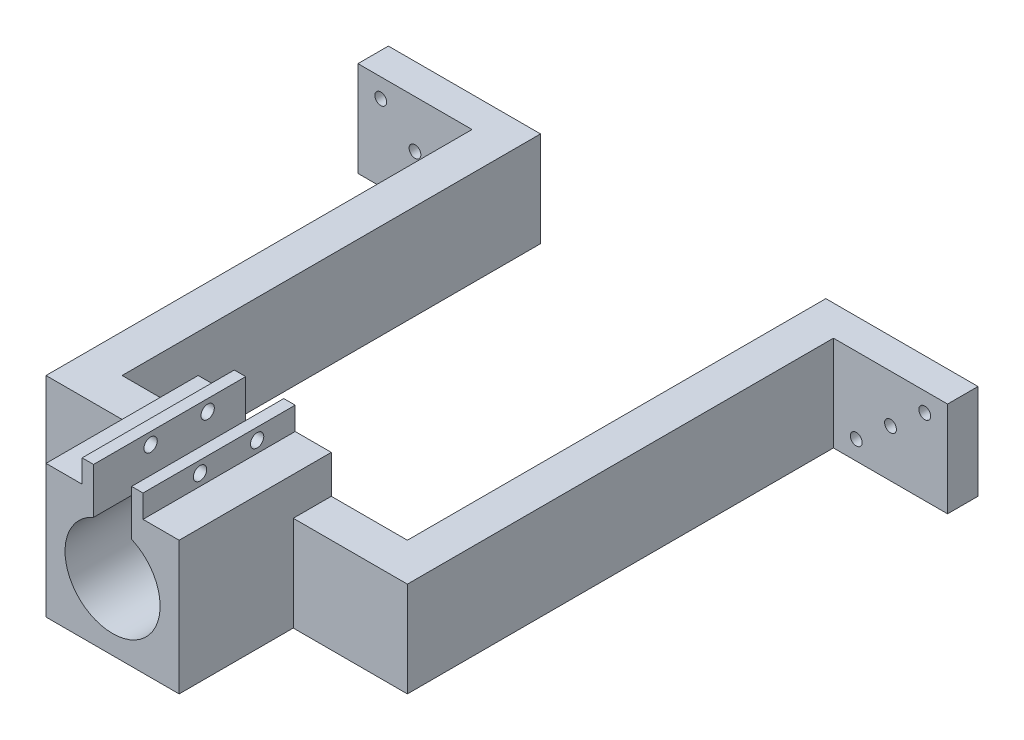
ISO-10303-21;
HEADER;
FILE_DESCRIPTION(('STEP AP214'),'2;1');
FILE_NAME('part.step','',(''),(''),'','','');
FILE_SCHEMA(('AUTOMOTIVE_DESIGN { 1 0 10303 214 1 1 1 1 }'));
ENDSEC;
DATA;
#1=APPLICATION_CONTEXT('core data for automotive mechanical design processes');
#2=APPLICATION_PROTOCOL_DEFINITION('international standard','automotive_design',2000,#1);
#3=PRODUCT_CONTEXT('',#1,'mechanical');
#4=PRODUCT('Part','Part','',(#3));
#5=PRODUCT_RELATED_PRODUCT_CATEGORY('part','',(#4));
#6=PRODUCT_DEFINITION_FORMATION('','',#4);
#7=PRODUCT_DEFINITION_CONTEXT('part definition',#1,'design');
#8=PRODUCT_DEFINITION('design','',#6,#7);
#9=PRODUCT_DEFINITION_SHAPE('','',#8);
#10=(LENGTH_UNIT() NAMED_UNIT(*) SI_UNIT(.MILLI.,.METRE.));
#11=(NAMED_UNIT(*) PLANE_ANGLE_UNIT() SI_UNIT($,.RADIAN.));
#12=(NAMED_UNIT(*) SI_UNIT($,.STERADIAN.) SOLID_ANGLE_UNIT());
#13=UNCERTAINTY_MEASURE_WITH_UNIT(LENGTH_MEASURE(1.E-05),#10,'distance_accuracy_value','');
#14=(GEOMETRIC_REPRESENTATION_CONTEXT(3) GLOBAL_UNCERTAINTY_ASSIGNED_CONTEXT((#13)) GLOBAL_UNIT_ASSIGNED_CONTEXT((#10,
#11,#12)) REPRESENTATION_CONTEXT('',''));
#15=CARTESIAN_POINT('',(0.,0.,0.));
#16=DIRECTION('',(0.,0.,1.));
#17=DIRECTION('',(1.,0.,0.));
#18=AXIS2_PLACEMENT_3D('',#15,#16,#17);
#19=CARTESIAN_POINT('',(0.,0.,0.));
#20=DIRECTION('',(0.,0.,1.));
#21=DIRECTION('',(1.,0.,0.));
#22=AXIS2_PLACEMENT_3D('',#19,#20,#21);
#23=PLANE('',#22);
#24=DIRECTION('',(1.,0.,0.));
#25=VECTOR('',#24,1.);
#26=CARTESIAN_POINT('',(0.,7.49999999999999,0.));
#27=LINE('',#26,#25);
#28=CARTESIAN_POINT('',(17.5,7.5,0.));
#29=VERTEX_POINT('',#28);
#30=CARTESIAN_POINT('',(37.5,7.5,0.));
#31=VERTEX_POINT('',#30);
#32=EDGE_CURVE('E437',#29,#31,#27,.T.);
#33=ORIENTED_EDGE('',*,*,#32,.T.);
#34=DIRECTION('',(0.,-1.,0.));
#35=VECTOR('',#34,1.);
#36=CARTESIAN_POINT('',(37.5,0.,0.));
#37=LINE('',#36,#35);
#38=CARTESIAN_POINT('',(37.5,-17.5,0.));
#39=VERTEX_POINT('',#38);
#40=EDGE_CURVE('E616',#31,#39,#37,.T.);
#41=ORIENTED_EDGE('',*,*,#40,.T.);
#42=DIRECTION('',(1.,0.,0.));
#43=VECTOR('',#42,1.);
#44=CARTESIAN_POINT('',(0.,-17.5,0.));
#45=LINE('',#44,#43);
#46=CARTESIAN_POINT('',(-37.5,-17.5,0.));
#47=VERTEX_POINT('',#46);
#48=EDGE_CURVE('E368',#47,#39,#45,.T.);
#49=ORIENTED_EDGE('',*,*,#48,.F.);
#50=DIRECTION('',(0.,-1.,0.));
#51=VECTOR('',#50,1.);
#52=CARTESIAN_POINT('',(-37.5,0.,0.));
#53=LINE('',#52,#51);
#54=CARTESIAN_POINT('',(-37.5,7.5,0.));
#55=VERTEX_POINT('',#54);
#56=EDGE_CURVE('E469',#55,#47,#53,.T.);
#57=ORIENTED_EDGE('',*,*,#56,.F.);
#58=DIRECTION('',(-1.,0.,0.));
#59=VECTOR('',#58,1.);
#60=CARTESIAN_POINT('',(0.,7.5,0.));
#61=LINE('',#60,#59);
#62=CARTESIAN_POINT('',(-17.5,7.5,0.));
#63=VERTEX_POINT('',#62);
#64=EDGE_CURVE('E462',#63,#55,#61,.T.);
#65=ORIENTED_EDGE('',*,*,#64,.F.);
#66=DIRECTION('',(0.,1.,0.));
#67=VECTOR('',#66,1.);
#68=CARTESIAN_POINT('',(-17.5,0.,0.));
#69=LINE('',#68,#67);
#70=CARTESIAN_POINT('',(-17.5,17.5,0.));
#71=VERTEX_POINT('',#70);
#72=EDGE_CURVE('E359',#63,#71,#69,.T.);
#73=ORIENTED_EDGE('',*,*,#72,.T.);
#74=DIRECTION('',(1.,0.,0.));
#75=VECTOR('',#74,1.);
#76=CARTESIAN_POINT('',(0.,17.5,0.));
#77=LINE('',#76,#75);
#78=CARTESIAN_POINT('',(-8.00000000000002,17.5,0.));
#79=VERTEX_POINT('',#78);
#80=EDGE_CURVE('E356',#71,#79,#77,.T.);
#81=ORIENTED_EDGE('',*,*,#80,.T.);
#82=DIRECTION('',(0.,1.,0.));
#83=VECTOR('',#82,1.);
#84=CARTESIAN_POINT('',(-8.00000000000002,0.,0.));
#85=LINE('',#84,#83);
#86=CARTESIAN_POINT('',(-8.00000000000002,23.5,0.));
#87=VERTEX_POINT('',#86);
#88=EDGE_CURVE('E353',#79,#87,#85,.T.);
#89=ORIENTED_EDGE('',*,*,#88,.T.);
#90=DIRECTION('',(-1.,0.,0.));
#91=VECTOR('',#90,1.);
#92=CARTESIAN_POINT('',(0.,23.5,0.));
#93=LINE('',#92,#91);
#94=CARTESIAN_POINT('',(-5.,23.5,0.));
#95=VERTEX_POINT('',#94);
#96=EDGE_CURVE('E350',#95,#87,#93,.T.);
#97=ORIENTED_EDGE('',*,*,#96,.F.);
#98=DIRECTION('',(0.,1.,0.));
#99=VECTOR('',#98,1.);
#100=CARTESIAN_POINT('',(-5.,0.,0.));
#101=LINE('',#100,#99);
#102=CARTESIAN_POINT('',(-5.,11.4564392373896,0.));
#103=VERTEX_POINT('',#102);
#104=EDGE_CURVE('E348',#103,#95,#101,.T.);
#105=ORIENTED_EDGE('',*,*,#104,.F.);
#106=CARTESIAN_POINT('',(0.,0.,0.));
#107=DIRECTION('',(0.,0.,1.));
#108=DIRECTION('',(1.,0.,0.));
#109=AXIS2_PLACEMENT_3D('',#106,#107,#108);
#110=CIRCLE('',#109,12.5);
#111=CARTESIAN_POINT('',(5.,11.4564392373896,0.));
#112=VERTEX_POINT('',#111);
#113=EDGE_CURVE('E314',#103,#112,#110,.T.);
#114=ORIENTED_EDGE('',*,*,#113,.T.);
#115=DIRECTION('',(0.,1.,0.));
#116=VECTOR('',#115,1.);
#117=CARTESIAN_POINT('',(5.,0.,0.));
#118=LINE('',#117,#116);
#119=CARTESIAN_POINT('',(5.,23.5,0.));
#120=VERTEX_POINT('',#119);
#121=EDGE_CURVE('E319',#112,#120,#118,.T.);
#122=ORIENTED_EDGE('',*,*,#121,.T.);
#123=DIRECTION('',(1.,0.,0.));
#124=VECTOR('',#123,1.);
#125=CARTESIAN_POINT('',(0.,23.5,0.));
#126=LINE('',#125,#124);
#127=CARTESIAN_POINT('',(7.99999999999999,23.5,0.));
#128=VERTEX_POINT('',#127);
#129=EDGE_CURVE('E409',#120,#128,#126,.T.);
#130=ORIENTED_EDGE('',*,*,#129,.T.);
#131=DIRECTION('',(0.,1.,0.));
#132=VECTOR('',#131,1.);
#133=CARTESIAN_POINT('',(7.99999999999999,0.,0.));
#134=LINE('',#133,#132);
#135=CARTESIAN_POINT('',(7.99999999999999,17.5,0.));
#136=VERTEX_POINT('',#135);
#137=EDGE_CURVE('E411',#136,#128,#134,.T.);
#138=ORIENTED_EDGE('',*,*,#137,.F.);
#139=CARTESIAN_POINT('',(17.5,17.5,0.));
#140=VERTEX_POINT('',#139);
#141=EDGE_CURVE('E360',#136,#140,#77,.T.);
#142=ORIENTED_EDGE('',*,*,#141,.T.);
#143=DIRECTION('',(0.,1.,0.));
#144=VECTOR('',#143,1.);
#145=CARTESIAN_POINT('',(17.5,0.,0.));
#146=LINE('',#145,#144);
#147=EDGE_CURVE('E435',#29,#140,#146,.T.);
#148=ORIENTED_EDGE('',*,*,#147,.F.);
#149=EDGE_LOOP('',(#33,#41,#49,#57,#65,#73,#81,#89,#97,#105,#114,#122,#130,#138,#142,#148));
#150=FACE_BOUND('',#149,.T.);
#151=ADVANCED_FACE('F35',(#150),#23,.F.);
#152=CARTESIAN_POINT('',(0.,0.,40.));
#153=DIRECTION('',(0.,0.,-1.));
#154=DIRECTION('',(-1.,0.,0.));
#155=AXIS2_PLACEMENT_3D('',#152,#153,#154);
#156=CYLINDRICAL_SURFACE('',#155,12.5);
#157=ORIENTED_EDGE('',*,*,#113,.F.);
#158=DIRECTION('',(0.,0.,-1.));
#159=VECTOR('',#158,1.);
#160=CARTESIAN_POINT('',(-5.,11.4564392373896,40.));
#161=LINE('',#160,#159);
#162=CARTESIAN_POINT('',(-5.,11.4564392373896,40.));
#163=VERTEX_POINT('',#162);
#164=EDGE_CURVE('E11',#163,#103,#161,.T.);
#165=ORIENTED_EDGE('',*,*,#164,.F.);
#166=CARTESIAN_POINT('',(0.,0.,40.));
#167=DIRECTION('',(0.,0.,1.));
#168=DIRECTION('',(1.,0.,0.));
#169=AXIS2_PLACEMENT_3D('',#166,#167,#168);
#170=CIRCLE('',#169,12.5);
#171=CARTESIAN_POINT('',(5.,11.4564392373896,40.));
#172=VERTEX_POINT('',#171);
#173=EDGE_CURVE('E315',#163,#172,#170,.T.);
#174=ORIENTED_EDGE('',*,*,#173,.T.);
#175=DIRECTION('',(0.,0.,-1.));
#176=VECTOR('',#175,1.);
#177=CARTESIAN_POINT('',(5.,11.4564392373896,40.));
#178=LINE('',#177,#176);
#179=EDGE_CURVE('E345',#172,#112,#178,.T.);
#180=ORIENTED_EDGE('',*,*,#179,.T.);
#181=EDGE_LOOP('',(#157,#165,#174,#180));
#182=FACE_BOUND('',#181,.T.);
#183=ADVANCED_FACE('F37',(#182),#156,.F.);
#184=CARTESIAN_POINT('',(-5.,0.,40.));
#185=DIRECTION('',(-1.,0.,0.));
#186=DIRECTION('',(0.,0.,1.));
#187=AXIS2_PLACEMENT_3D('',#184,#185,#186);
#188=PLANE('',#187);
#189=CARTESIAN_POINT('',(-5.,20.5,10.));
#190=DIRECTION('',(-1.,0.,0.));
#191=DIRECTION('',(0.,0.,1.));
#192=AXIS2_PLACEMENT_3D('',#189,#190,#191);
#193=CIRCLE('',#192,1.75);
#194=CARTESIAN_POINT('',(-5.,20.5,11.75));
#195=VERTEX_POINT('',#194);
#196=EDGE_CURVE('E301',#195,#195,#193,.T.);
#197=ORIENTED_EDGE('',*,*,#196,.T.);
#198=EDGE_LOOP('',(#197));
#199=FACE_BOUND('',#198,.T.);
#200=CARTESIAN_POINT('',(-5.,20.5,25.));
#201=DIRECTION('',(-1.,0.,0.));
#202=DIRECTION('',(0.,0.,1.));
#203=AXIS2_PLACEMENT_3D('',#200,#201,#202);
#204=CIRCLE('',#203,1.75);
#205=CARTESIAN_POINT('',(-5.,20.5,26.75));
#206=VERTEX_POINT('',#205);
#207=EDGE_CURVE('E311',#206,#206,#204,.T.);
#208=ORIENTED_EDGE('',*,*,#207,.T.);
#209=EDGE_LOOP('',(#208));
#210=FACE_BOUND('',#209,.T.);
#211=ORIENTED_EDGE('',*,*,#104,.T.);
#212=DIRECTION('',(0.,0.,-1.));
#213=VECTOR('',#212,1.);
#214=CARTESIAN_POINT('',(-5.,23.5,40.));
#215=LINE('',#214,#213);
#216=CARTESIAN_POINT('',(-5.,23.5,40.));
#217=VERTEX_POINT('',#216);
#218=EDGE_CURVE('E44',#217,#95,#215,.T.);
#219=ORIENTED_EDGE('',*,*,#218,.F.);
#220=DIRECTION('',(0.,1.,0.));
#221=VECTOR('',#220,1.);
#222=CARTESIAN_POINT('',(-5.,0.,40.));
#223=LINE('',#222,#221);
#224=EDGE_CURVE('E318',#163,#217,#223,.T.);
#225=ORIENTED_EDGE('',*,*,#224,.F.);
#226=ORIENTED_EDGE('',*,*,#164,.T.);
#227=EDGE_LOOP('',(#211,#219,#225,#226));
#228=FACE_BOUND('',#227,.T.);
#229=ADVANCED_FACE('F550',(#199,#210,#228),#188,.F.);
#230=CARTESIAN_POINT('',(0.,23.5,40.));
#231=DIRECTION('',(0.,-1.,0.));
#232=DIRECTION('',(0.,0.,-1.));
#233=AXIS2_PLACEMENT_3D('',#230,#231,#232);
#234=PLANE('',#233);
#235=ORIENTED_EDGE('',*,*,#96,.T.);
#236=DIRECTION('',(0.,0.,-1.));
#237=VECTOR('',#236,1.);
#238=CARTESIAN_POINT('',(-8.00000000000002,23.5,40.));
#239=LINE('',#238,#237);
#240=CARTESIAN_POINT('',(-8.00000000000002,23.5,40.));
#241=VERTEX_POINT('',#240);
#242=EDGE_CURVE('E387',#241,#87,#239,.T.);
#243=ORIENTED_EDGE('',*,*,#242,.F.);
#244=DIRECTION('',(-1.,0.,0.));
#245=VECTOR('',#244,1.);
#246=CARTESIAN_POINT('',(0.,23.5,40.));
#247=LINE('',#246,#245);
#248=EDGE_CURVE('E321',#217,#241,#247,.T.);
#249=ORIENTED_EDGE('',*,*,#248,.F.);
#250=ORIENTED_EDGE('',*,*,#218,.T.);
#251=EDGE_LOOP('',(#235,#243,#249,#250));
#252=FACE_BOUND('',#251,.T.);
#253=ADVANCED_FACE('F576',(#252),#234,.F.);
#254=CARTESIAN_POINT('',(-8.00000000000002,0.,40.));
#255=DIRECTION('',(-1.,0.,0.));
#256=DIRECTION('',(0.,0.,1.));
#257=AXIS2_PLACEMENT_3D('',#254,#255,#256);
#258=PLANE('',#257);
#259=CARTESIAN_POINT('',(-8.00000000000002,20.5,10.));
#260=DIRECTION('',(-1.,0.,0.));
#261=DIRECTION('',(0.,0.,1.));
#262=AXIS2_PLACEMENT_3D('',#259,#260,#261);
#263=CIRCLE('',#262,1.75);
#264=CARTESIAN_POINT('',(-8.00000000000002,20.5,11.75));
#265=VERTEX_POINT('',#264);
#266=EDGE_CURVE('E298',#265,#265,#263,.T.);
#267=ORIENTED_EDGE('',*,*,#266,.F.);
#268=EDGE_LOOP('',(#267));
#269=FACE_BOUND('',#268,.T.);
#270=CARTESIAN_POINT('',(-8.00000000000002,20.5,25.));
#271=DIRECTION('',(-1.,0.,0.));
#272=DIRECTION('',(0.,0.,1.));
#273=AXIS2_PLACEMENT_3D('',#270,#271,#272);
#274=CIRCLE('',#273,1.75);
#275=CARTESIAN_POINT('',(-8.00000000000002,20.5,26.75));
#276=VERTEX_POINT('',#275);
#277=EDGE_CURVE('E308',#276,#276,#274,.T.);
#278=ORIENTED_EDGE('',*,*,#277,.F.);
#279=EDGE_LOOP('',(#278));
#280=FACE_BOUND('',#279,.T.);
#281=ORIENTED_EDGE('',*,*,#88,.F.);
#282=DIRECTION('',(0.,0.,-1.));
#283=VECTOR('',#282,1.);
#284=CARTESIAN_POINT('',(-8.00000000000002,17.5,40.));
#285=LINE('',#284,#283);
#286=CARTESIAN_POINT('',(-8.00000000000002,17.5,40.));
#287=VERTEX_POINT('',#286);
#288=EDGE_CURVE('E385',#287,#79,#285,.T.);
#289=ORIENTED_EDGE('',*,*,#288,.F.);
#290=DIRECTION('',(0.,1.,0.));
#291=VECTOR('',#290,1.);
#292=CARTESIAN_POINT('',(-8.00000000000002,0.,40.));
#293=LINE('',#292,#291);
#294=EDGE_CURVE('E323',#287,#241,#293,.T.);
#295=ORIENTED_EDGE('',*,*,#294,.T.);
#296=ORIENTED_EDGE('',*,*,#242,.T.);
#297=EDGE_LOOP('',(#281,#289,#295,#296));
#298=FACE_BOUND('',#297,.T.);
#299=ADVANCED_FACE('F573',(#269,#280,#298),#258,.T.);
#300=CARTESIAN_POINT('',(0.,17.5,40.));
#301=DIRECTION('',(0.,1.,0.));
#302=DIRECTION('',(0.,0.,1.));
#303=AXIS2_PLACEMENT_3D('',#300,#301,#302);
#304=PLANE('',#303);
#305=ORIENTED_EDGE('',*,*,#80,.F.);
#306=DIRECTION('',(0.,0.,-1.));
#307=VECTOR('',#306,1.);
#308=CARTESIAN_POINT('',(-17.5,17.5,40.));
#309=LINE('',#308,#307);
#310=CARTESIAN_POINT('',(-17.5,17.5,40.));
#311=VERTEX_POINT('',#310);
#312=EDGE_CURVE('E374',#311,#71,#309,.T.);
#313=ORIENTED_EDGE('',*,*,#312,.F.);
#314=DIRECTION('',(1.,0.,0.));
#315=VECTOR('',#314,1.);
#316=CARTESIAN_POINT('',(0.,17.5,40.));
#317=LINE('',#316,#315);
#318=EDGE_CURVE('E326',#311,#287,#317,.T.);
#319=ORIENTED_EDGE('',*,*,#318,.T.);
#320=ORIENTED_EDGE('',*,*,#288,.T.);
#321=EDGE_LOOP('',(#305,#313,#319,#320));
#322=FACE_BOUND('',#321,.T.);
#323=ADVANCED_FACE('F565',(#322),#304,.T.);
#324=CARTESIAN_POINT('',(-17.5,0.,40.));
#325=DIRECTION('',(-1.,0.,0.));
#326=DIRECTION('',(0.,0.,1.));
#327=AXIS2_PLACEMENT_3D('',#324,#325,#326);
#328=PLANE('',#327);
#329=DIRECTION('',(0.,0.,-1.));
#330=VECTOR('',#329,1.);
#331=CARTESIAN_POINT('',(-17.5,7.5,10.));
#332=LINE('',#331,#330);
#333=CARTESIAN_POINT('',(-17.5,7.5,10.));
#334=VERTEX_POINT('',#333);
#335=EDGE_CURVE('E516',#334,#63,#332,.T.);
#336=ORIENTED_EDGE('',*,*,#335,.F.);
#337=DIRECTION('',(0.,1.,0.));
#338=VECTOR('',#337,1.);
#339=CARTESIAN_POINT('',(-17.5,0.,10.));
#340=LINE('',#339,#338);
#341=CARTESIAN_POINT('',(-17.5,-17.5,9.99999999999999));
#342=VERTEX_POINT('',#341);
#343=EDGE_CURVE('E376',#342,#334,#340,.T.);
#344=ORIENTED_EDGE('',*,*,#343,.F.);
#345=DIRECTION('',(0.,0.,-1.));
#346=VECTOR('',#345,1.);
#347=CARTESIAN_POINT('',(-17.5,-17.5,40.));
#348=LINE('',#347,#346);
#349=CARTESIAN_POINT('',(-17.5,-17.5,40.));
#350=VERTEX_POINT('',#349);
#351=EDGE_CURVE('E370',#350,#342,#348,.T.);
#352=ORIENTED_EDGE('',*,*,#351,.F.);
#353=DIRECTION('',(0.,1.,0.));
#354=VECTOR('',#353,1.);
#355=CARTESIAN_POINT('',(-17.5,0.,40.));
#356=LINE('',#355,#354);
#357=EDGE_CURVE('E329',#350,#311,#356,.T.);
#358=ORIENTED_EDGE('',*,*,#357,.T.);
#359=ORIENTED_EDGE('',*,*,#312,.T.);
#360=ORIENTED_EDGE('',*,*,#72,.F.);
#361=EDGE_LOOP('',(#336,#344,#352,#358,#359,#360));
#362=FACE_BOUND('',#361,.T.);
#363=ADVANCED_FACE('F570',(#362),#328,.T.);
#364=CARTESIAN_POINT('',(0.,-17.5,40.));
#365=DIRECTION('',(0.,1.,0.));
#366=DIRECTION('',(0.,0.,1.));
#367=AXIS2_PLACEMENT_3D('',#364,#365,#366);
#368=PLANE('',#367);
#369=DIRECTION('',(0.,0.,-1.));
#370=VECTOR('',#369,1.);
#371=CARTESIAN_POINT('',(-47.5,-17.5,10.));
#372=LINE('',#371,#370);
#373=CARTESIAN_POINT('',(-47.5,-17.5,10.));
#374=VERTEX_POINT('',#373);
#375=CARTESIAN_POINT('',(-47.5,-17.5,-102.));
#376=VERTEX_POINT('',#375);
#377=EDGE_CURVE('E234',#374,#376,#372,.T.);
#378=ORIENTED_EDGE('',*,*,#377,.T.);
#379=DIRECTION('',(-1.,0.,0.));
#380=VECTOR('',#379,1.);
#381=CARTESIAN_POINT('',(0.,-17.5,-102.));
#382=LINE('',#381,#380);
#383=CARTESIAN_POINT('',(-77.5,-17.5,-102.));
#384=VERTEX_POINT('',#383);
#385=EDGE_CURVE('E226',#376,#384,#382,.T.);
#386=ORIENTED_EDGE('',*,*,#385,.T.);
#387=DIRECTION('',(0.,0.,-1.));
#388=VECTOR('',#387,1.);
#389=CARTESIAN_POINT('',(-77.5,-17.5,-102.));
#390=LINE('',#389,#388);
#391=CARTESIAN_POINT('',(-77.5,-17.5,-110.));
#392=VERTEX_POINT('',#391);
#393=EDGE_CURVE('E211',#384,#392,#390,.T.);
#394=ORIENTED_EDGE('',*,*,#393,.T.);
#395=DIRECTION('',(-1.,0.,0.));
#396=VECTOR('',#395,1.);
#397=CARTESIAN_POINT('',(0.,-17.5,-110.));
#398=LINE('',#397,#396);
#399=CARTESIAN_POINT('',(-37.5,-17.5,-110.));
#400=VERTEX_POINT('',#399);
#401=EDGE_CURVE('E468',#400,#392,#398,.T.);
#402=ORIENTED_EDGE('',*,*,#401,.F.);
#403=DIRECTION('',(0.,0.,1.));
#404=VECTOR('',#403,1.);
#405=CARTESIAN_POINT('',(-37.5,-17.5,-110.));
#406=LINE('',#405,#404);
#407=EDGE_CURVE('E440',#400,#47,#406,.T.);
#408=ORIENTED_EDGE('',*,*,#407,.T.);
#409=ORIENTED_EDGE('',*,*,#48,.T.);
#410=DIRECTION('',(0.,0.,1.));
#411=VECTOR('',#410,1.);
#412=CARTESIAN_POINT('',(37.5,-17.5,-110.));
#413=LINE('',#412,#411);
#414=CARTESIAN_POINT('',(37.5,-17.5,-110.));
#415=VERTEX_POINT('',#414);
#416=EDGE_CURVE('E474',#415,#39,#413,.T.);
#417=ORIENTED_EDGE('',*,*,#416,.F.);
#418=DIRECTION('',(1.,0.,0.));
#419=VECTOR('',#418,1.);
#420=CARTESIAN_POINT('',(0.,-17.5,-110.));
#421=LINE('',#420,#419);
#422=CARTESIAN_POINT('',(77.5,-17.5,-110.));
#423=VERTEX_POINT('',#422);
#424=EDGE_CURVE('E624',#415,#423,#421,.T.);
#425=ORIENTED_EDGE('',*,*,#424,.T.);
#426=DIRECTION('',(0.,0.,-1.));
#427=VECTOR('',#426,1.);
#428=CARTESIAN_POINT('',(77.5,-17.5,-102.));
#429=LINE('',#428,#427);
#430=CARTESIAN_POINT('',(77.5,-17.5,-102.));
#431=VERTEX_POINT('',#430);
#432=EDGE_CURVE('E627',#431,#423,#429,.T.);
#433=ORIENTED_EDGE('',*,*,#432,.F.);
#434=DIRECTION('',(1.,0.,0.));
#435=VECTOR('',#434,1.);
#436=CARTESIAN_POINT('',(0.,-17.5,-102.));
#437=LINE('',#436,#435);
#438=CARTESIAN_POINT('',(47.5,-17.5,-102.));
#439=VERTEX_POINT('',#438);
#440=EDGE_CURVE('E265',#439,#431,#437,.T.);
#441=ORIENTED_EDGE('',*,*,#440,.F.);
#442=DIRECTION('',(0.,0.,-1.));
#443=VECTOR('',#442,1.);
#444=CARTESIAN_POINT('',(47.5,-17.5,10.));
#445=LINE('',#444,#443);
#446=CARTESIAN_POINT('',(47.5,-17.5,10.));
#447=VERTEX_POINT('',#446);
#448=EDGE_CURVE('E459',#447,#439,#445,.T.);
#449=ORIENTED_EDGE('',*,*,#448,.F.);
#450=DIRECTION('',(1.,0.,0.));
#451=VECTOR('',#450,1.);
#452=CARTESIAN_POINT('',(0.,-17.5,10.));
#453=LINE('',#452,#451);
#454=CARTESIAN_POINT('',(17.5,-17.5,10.));
#455=VERTEX_POINT('',#454);
#456=EDGE_CURVE('E439',#455,#447,#453,.T.);
#457=ORIENTED_EDGE('',*,*,#456,.F.);
#458=DIRECTION('',(0.,0.,-1.));
#459=VECTOR('',#458,1.);
#460=CARTESIAN_POINT('',(17.5,-17.5,40.));
#461=LINE('',#460,#459);
#462=CARTESIAN_POINT('',(17.5,-17.5,40.));
#463=VERTEX_POINT('',#462);
#464=EDGE_CURVE('E375',#463,#455,#461,.T.);
#465=ORIENTED_EDGE('',*,*,#464,.F.);
#466=DIRECTION('',(1.,0.,0.));
#467=VECTOR('',#466,1.);
#468=CARTESIAN_POINT('',(0.,-17.5,40.));
#469=LINE('',#468,#467);
#470=EDGE_CURVE('E333',#350,#463,#469,.T.);
#471=ORIENTED_EDGE('',*,*,#470,.F.);
#472=ORIENTED_EDGE('',*,*,#351,.T.);
#473=DIRECTION('',(-1.,0.,0.));
#474=VECTOR('',#473,1.);
#475=CARTESIAN_POINT('',(0.,-17.5,10.));
#476=LINE('',#475,#474);
#477=EDGE_CURVE('E526',#342,#374,#476,.T.);
#478=ORIENTED_EDGE('',*,*,#477,.T.);
#479=EDGE_LOOP('',(#378,#386,#394,#402,#408,#409,#417,#425,#433,#441,#449,#457,#465,#471,#472,#478));
#480=FACE_BOUND('',#479,.T.);
#481=ADVANCED_FACE('F232',(#480),#368,.F.);
#482=CARTESIAN_POINT('',(17.5,0.,40.));
#483=DIRECTION('',(-1.,0.,0.));
#484=DIRECTION('',(0.,0.,1.));
#485=AXIS2_PLACEMENT_3D('',#482,#483,#484);
#486=PLANE('',#485);
#487=ORIENTED_EDGE('',*,*,#464,.T.);
#488=DIRECTION('',(0.,1.,0.));
#489=VECTOR('',#488,1.);
#490=CARTESIAN_POINT('',(17.5,0.,10.));
#491=LINE('',#490,#489);
#492=CARTESIAN_POINT('',(17.5,7.5,10.));
#493=VERTEX_POINT('',#492);
#494=EDGE_CURVE('E447',#455,#493,#491,.T.);
#495=ORIENTED_EDGE('',*,*,#494,.T.);
#496=DIRECTION('',(0.,0.,-1.));
#497=VECTOR('',#496,1.);
#498=CARTESIAN_POINT('',(17.5,7.5,10.));
#499=LINE('',#498,#497);
#500=EDGE_CURVE('E443',#493,#29,#499,.T.);
#501=ORIENTED_EDGE('',*,*,#500,.T.);
#502=ORIENTED_EDGE('',*,*,#147,.T.);
#503=DIRECTION('',(0.,0.,-1.));
#504=VECTOR('',#503,1.);
#505=CARTESIAN_POINT('',(17.5,17.5,40.));
#506=LINE('',#505,#504);
#507=CARTESIAN_POINT('',(17.5,17.5,40.));
#508=VERTEX_POINT('',#507);
#509=EDGE_CURVE('E420',#508,#140,#506,.T.);
#510=ORIENTED_EDGE('',*,*,#509,.F.);
#511=DIRECTION('',(0.,1.,0.));
#512=VECTOR('',#511,1.);
#513=CARTESIAN_POINT('',(17.5,0.,40.));
#514=LINE('',#513,#512);
#515=EDGE_CURVE('E335',#463,#508,#514,.T.);
#516=ORIENTED_EDGE('',*,*,#515,.F.);
#517=EDGE_LOOP('',(#487,#495,#501,#502,#510,#516));
#518=FACE_BOUND('',#517,.T.);
#519=ADVANCED_FACE('F495',(#518),#486,.F.);
#520=ORIENTED_EDGE('',*,*,#141,.F.);
#521=DIRECTION('',(0.,0.,-1.));
#522=VECTOR('',#521,1.);
#523=CARTESIAN_POINT('',(7.99999999999999,17.5,40.));
#524=LINE('',#523,#522);
#525=CARTESIAN_POINT('',(7.99999999999999,17.5,40.));
#526=VERTEX_POINT('',#525);
#527=EDGE_CURVE('E419',#526,#136,#524,.T.);
#528=ORIENTED_EDGE('',*,*,#527,.F.);
#529=EDGE_CURVE('E330',#526,#508,#317,.T.);
#530=ORIENTED_EDGE('',*,*,#529,.T.);
#531=ORIENTED_EDGE('',*,*,#509,.T.);
#532=EDGE_LOOP('',(#520,#528,#530,#531));
#533=FACE_BOUND('',#532,.T.);
#534=ADVANCED_FACE('F561',(#533),#304,.T.);
#535=CARTESIAN_POINT('',(7.99999999999999,0.,40.));
#536=DIRECTION('',(-1.,0.,0.));
#537=DIRECTION('',(0.,0.,1.));
#538=AXIS2_PLACEMENT_3D('',#535,#536,#537);
#539=PLANE('',#538);
#540=CARTESIAN_POINT('',(7.99999999999999,20.5,10.));
#541=DIRECTION('',(1.,0.,0.));
#542=DIRECTION('',(0.,0.,-1.));
#543=AXIS2_PLACEMENT_3D('',#540,#541,#542);
#544=CIRCLE('',#543,1.75);
#545=CARTESIAN_POINT('',(7.99999999999999,20.5,8.25));
#546=VERTEX_POINT('',#545);
#547=EDGE_CURVE('E289',#546,#546,#544,.T.);
#548=ORIENTED_EDGE('',*,*,#547,.F.);
#549=EDGE_LOOP('',(#548));
#550=FACE_BOUND('',#549,.T.);
#551=CARTESIAN_POINT('',(7.99999999999999,20.5,25.));
#552=DIRECTION('',(1.,0.,0.));
#553=DIRECTION('',(0.,0.,-1.));
#554=AXIS2_PLACEMENT_3D('',#551,#552,#553);
#555=CIRCLE('',#554,1.75);
#556=CARTESIAN_POINT('',(7.99999999999999,20.5,23.25));
#557=VERTEX_POINT('',#556);
#558=EDGE_CURVE('E304',#557,#557,#555,.T.);
#559=ORIENTED_EDGE('',*,*,#558,.F.);
#560=EDGE_LOOP('',(#559));
#561=FACE_BOUND('',#560,.T.);
#562=ORIENTED_EDGE('',*,*,#137,.T.);
#563=DIRECTION('',(0.,0.,-1.));
#564=VECTOR('',#563,1.);
#565=CARTESIAN_POINT('',(7.99999999999999,23.5,40.));
#566=LINE('',#565,#564);
#567=CARTESIAN_POINT('',(7.99999999999999,23.5,40.));
#568=VERTEX_POINT('',#567);
#569=EDGE_CURVE('E417',#568,#128,#566,.T.);
#570=ORIENTED_EDGE('',*,*,#569,.F.);
#571=DIRECTION('',(0.,1.,0.));
#572=VECTOR('',#571,1.);
#573=CARTESIAN_POINT('',(7.99999999999999,0.,40.));
#574=LINE('',#573,#572);
#575=EDGE_CURVE('E337',#526,#568,#574,.T.);
#576=ORIENTED_EDGE('',*,*,#575,.F.);
#577=ORIENTED_EDGE('',*,*,#527,.T.);
#578=EDGE_LOOP('',(#562,#570,#576,#577));
#579=FACE_BOUND('',#578,.T.);
#580=ADVANCED_FACE('F557',(#550,#561,#579),#539,.F.);
#581=CARTESIAN_POINT('',(0.,23.5,40.));
#582=DIRECTION('',(0.,1.,0.));
#583=DIRECTION('',(0.,0.,1.));
#584=AXIS2_PLACEMENT_3D('',#581,#582,#583);
#585=PLANE('',#584);
#586=ORIENTED_EDGE('',*,*,#129,.F.);
#587=DIRECTION('',(0.,0.,-1.));
#588=VECTOR('',#587,1.);
#589=CARTESIAN_POINT('',(5.,23.5,40.));
#590=LINE('',#589,#588);
#591=CARTESIAN_POINT('',(5.,23.5,40.));
#592=VERTEX_POINT('',#591);
#593=EDGE_CURVE('E405',#592,#120,#590,.T.);
#594=ORIENTED_EDGE('',*,*,#593,.F.);
#595=DIRECTION('',(1.,0.,0.));
#596=VECTOR('',#595,1.);
#597=CARTESIAN_POINT('',(0.,23.5,40.));
#598=LINE('',#597,#596);
#599=EDGE_CURVE('E339',#592,#568,#598,.T.);
#600=ORIENTED_EDGE('',*,*,#599,.T.);
#601=ORIENTED_EDGE('',*,*,#569,.T.);
#602=EDGE_LOOP('',(#586,#594,#600,#601));
#603=FACE_BOUND('',#602,.T.);
#604=ADVANCED_FACE('F400',(#603),#585,.T.);
#605=CARTESIAN_POINT('',(5.,0.,40.));
#606=DIRECTION('',(-1.,0.,0.));
#607=DIRECTION('',(0.,-1.,0.));
#608=AXIS2_PLACEMENT_3D('',#605,#606,#607);
#609=PLANE('',#608);
#610=CARTESIAN_POINT('',(5.,20.5,10.));
#611=DIRECTION('',(-1.,0.,0.));
#612=DIRECTION('',(0.,-1.,0.));
#613=AXIS2_PLACEMENT_3D('',#610,#611,#612);
#614=CIRCLE('',#613,1.75);
#615=CARTESIAN_POINT('',(5.,18.75,10.));
#616=VERTEX_POINT('',#615);
#617=EDGE_CURVE('E297',#616,#616,#614,.T.);
#618=ORIENTED_EDGE('',*,*,#617,.F.);
#619=EDGE_LOOP('',(#618));
#620=FACE_BOUND('',#619,.T.);
#621=CARTESIAN_POINT('',(5.,20.5,25.));
#622=DIRECTION('',(-1.,0.,0.));
#623=DIRECTION('',(0.,-1.,0.));
#624=AXIS2_PLACEMENT_3D('',#621,#622,#623);
#625=CIRCLE('',#624,1.75);
#626=CARTESIAN_POINT('',(5.,18.75,25.));
#627=VERTEX_POINT('',#626);
#628=EDGE_CURVE('E307',#627,#627,#625,.T.);
#629=ORIENTED_EDGE('',*,*,#628,.F.);
#630=EDGE_LOOP('',(#629));
#631=FACE_BOUND('',#630,.T.);
#632=ORIENTED_EDGE('',*,*,#121,.F.);
#633=ORIENTED_EDGE('',*,*,#179,.F.);
#634=DIRECTION('',(0.,1.,0.));
#635=VECTOR('',#634,1.);
#636=CARTESIAN_POINT('',(5.,0.,40.));
#637=LINE('',#636,#635);
#638=EDGE_CURVE('E342',#172,#592,#637,.T.);
#639=ORIENTED_EDGE('',*,*,#638,.T.);
#640=ORIENTED_EDGE('',*,*,#593,.T.);
#641=EDGE_LOOP('',(#632,#633,#639,#640));
#642=FACE_BOUND('',#641,.T.);
#643=ADVANCED_FACE('F396',(#620,#631,#642),#609,.T.);
#644=CARTESIAN_POINT('',(0.,0.,40.));
#645=DIRECTION('',(0.,0.,1.));
#646=DIRECTION('',(1.,0.,0.));
#647=AXIS2_PLACEMENT_3D('',#644,#645,#646);
#648=PLANE('',#647);
#649=ORIENTED_EDGE('',*,*,#173,.F.);
#650=ORIENTED_EDGE('',*,*,#224,.T.);
#651=ORIENTED_EDGE('',*,*,#248,.T.);
#652=ORIENTED_EDGE('',*,*,#294,.F.);
#653=ORIENTED_EDGE('',*,*,#318,.F.);
#654=ORIENTED_EDGE('',*,*,#357,.F.);
#655=ORIENTED_EDGE('',*,*,#470,.T.);
#656=ORIENTED_EDGE('',*,*,#515,.T.);
#657=ORIENTED_EDGE('',*,*,#529,.F.);
#658=ORIENTED_EDGE('',*,*,#575,.T.);
#659=ORIENTED_EDGE('',*,*,#599,.F.);
#660=ORIENTED_EDGE('',*,*,#638,.F.);
#661=EDGE_LOOP('',(#649,#650,#651,#652,#653,#654,#655,#656,#657,#658,#659,#660));
#662=FACE_BOUND('',#661,.T.);
#663=ADVANCED_FACE('F399',(#662),#648,.T.);
#664=CARTESIAN_POINT('',(-12.,20.5,25.));
#665=DIRECTION('',(1.,0.,0.));
#666=DIRECTION('',(0.,0.,-1.));
#667=AXIS2_PLACEMENT_3D('',#664,#665,#666);
#668=CYLINDRICAL_SURFACE('',#667,1.75);
#669=ORIENTED_EDGE('',*,*,#628,.T.);
#670=EDGE_LOOP('',(#669));
#671=FACE_BOUND('',#670,.T.);
#672=ORIENTED_EDGE('',*,*,#558,.T.);
#673=EDGE_LOOP('',(#672));
#674=FACE_BOUND('',#673,.T.);
#675=ADVANCED_FACE('F393',(#671,#674),#668,.F.);
#676=ORIENTED_EDGE('',*,*,#277,.T.);
#677=EDGE_LOOP('',(#676));
#678=FACE_BOUND('',#677,.T.);
#679=ORIENTED_EDGE('',*,*,#207,.F.);
#680=EDGE_LOOP('',(#679));
#681=FACE_BOUND('',#680,.T.);
#682=ADVANCED_FACE('F874',(#678,#681),#668,.F.);
#683=CARTESIAN_POINT('',(-12.,20.5,10.));
#684=DIRECTION('',(1.,0.,0.));
#685=DIRECTION('',(0.,0.,-1.));
#686=AXIS2_PLACEMENT_3D('',#683,#684,#685);
#687=CYLINDRICAL_SURFACE('',#686,1.75);
#688=ORIENTED_EDGE('',*,*,#617,.T.);
#689=EDGE_LOOP('',(#688));
#690=FACE_BOUND('',#689,.T.);
#691=ORIENTED_EDGE('',*,*,#547,.T.);
#692=EDGE_LOOP('',(#691));
#693=FACE_BOUND('',#692,.T.);
#694=ADVANCED_FACE('F880',(#690,#693),#687,.F.);
#695=ORIENTED_EDGE('',*,*,#266,.T.);
#696=EDGE_LOOP('',(#695));
#697=FACE_BOUND('',#696,.T.);
#698=ORIENTED_EDGE('',*,*,#196,.F.);
#699=EDGE_LOOP('',(#698));
#700=FACE_BOUND('',#699,.T.);
#701=ADVANCED_FACE('F543',(#697,#700),#687,.F.);
#702=CARTESIAN_POINT('',(0.,7.5,10.));
#703=DIRECTION('',(0.,-1.,0.));
#704=DIRECTION('',(1.,0.,0.));
#705=AXIS2_PLACEMENT_3D('',#702,#703,#704);
#706=PLANE('',#705);
#707=ORIENTED_EDGE('',*,*,#64,.T.);
#708=DIRECTION('',(0.,0.,1.));
#709=VECTOR('',#708,1.);
#710=CARTESIAN_POINT('',(-37.5,7.5,-110.));
#711=LINE('',#710,#709);
#712=CARTESIAN_POINT('',(-37.5,7.5,-110.));
#713=VERTEX_POINT('',#712);
#714=EDGE_CURVE('E465',#713,#55,#711,.T.);
#715=ORIENTED_EDGE('',*,*,#714,.F.);
#716=DIRECTION('',(-1.,0.,0.));
#717=VECTOR('',#716,1.);
#718=CARTESIAN_POINT('',(0.,7.5,-110.));
#719=LINE('',#718,#717);
#720=CARTESIAN_POINT('',(-77.5,7.5,-110.));
#721=VERTEX_POINT('',#720);
#722=EDGE_CURVE('E637',#713,#721,#719,.T.);
#723=ORIENTED_EDGE('',*,*,#722,.T.);
#724=DIRECTION('',(0.,0.,-1.));
#725=VECTOR('',#724,1.);
#726=CARTESIAN_POINT('',(-77.5,7.5,-102.));
#727=LINE('',#726,#725);
#728=CARTESIAN_POINT('',(-77.5,7.5,-102.));
#729=VERTEX_POINT('',#728);
#730=EDGE_CURVE('E221',#729,#721,#727,.T.);
#731=ORIENTED_EDGE('',*,*,#730,.F.);
#732=DIRECTION('',(-1.,0.,0.));
#733=VECTOR('',#732,1.);
#734=CARTESIAN_POINT('',(0.,7.49999999999998,-102.));
#735=LINE('',#734,#733);
#736=CARTESIAN_POINT('',(-47.5,7.5,-102.));
#737=VERTEX_POINT('',#736);
#738=EDGE_CURVE('E228',#737,#729,#735,.T.);
#739=ORIENTED_EDGE('',*,*,#738,.F.);
#740=DIRECTION('',(0.,0.,-1.));
#741=VECTOR('',#740,1.);
#742=CARTESIAN_POINT('',(-47.5,7.5,10.));
#743=LINE('',#742,#741);
#744=CARTESIAN_POINT('',(-47.5,7.5,10.));
#745=VERTEX_POINT('',#744);
#746=EDGE_CURVE('E286',#745,#737,#743,.T.);
#747=ORIENTED_EDGE('',*,*,#746,.F.);
#748=DIRECTION('',(-1.,0.,0.));
#749=VECTOR('',#748,1.);
#750=CARTESIAN_POINT('',(0.,7.5,10.));
#751=LINE('',#750,#749);
#752=EDGE_CURVE('E457',#334,#745,#751,.T.);
#753=ORIENTED_EDGE('',*,*,#752,.F.);
#754=ORIENTED_EDGE('',*,*,#335,.T.);
#755=EDGE_LOOP('',(#707,#715,#723,#731,#739,#747,#753,#754));
#756=FACE_BOUND('',#755,.T.);
#757=ADVANCED_FACE('F514',(#756),#706,.F.);
#758=CARTESIAN_POINT('',(-47.5,0.,10.));
#759=DIRECTION('',(-1.,0.,0.));
#760=DIRECTION('',(0.,-1.,0.));
#761=AXIS2_PLACEMENT_3D('',#758,#759,#760);
#762=PLANE('',#761);
#763=DIRECTION('',(0.,1.,0.));
#764=VECTOR('',#763,1.);
#765=CARTESIAN_POINT('',(-47.5,0.,-102.));
#766=LINE('',#765,#764);
#767=EDGE_CURVE('E52',#376,#737,#766,.T.);
#768=ORIENTED_EDGE('',*,*,#767,.F.);
#769=ORIENTED_EDGE('',*,*,#377,.F.);
#770=DIRECTION('',(0.,1.,0.));
#771=VECTOR('',#770,1.);
#772=CARTESIAN_POINT('',(-47.5,0.,10.));
#773=LINE('',#772,#771);
#774=EDGE_CURVE('E518',#374,#745,#773,.T.);
#775=ORIENTED_EDGE('',*,*,#774,.T.);
#776=ORIENTED_EDGE('',*,*,#746,.T.);
#777=EDGE_LOOP('',(#768,#769,#775,#776));
#778=FACE_BOUND('',#777,.T.);
#779=ADVANCED_FACE('F535',(#778),#762,.T.);
#780=CARTESIAN_POINT('',(0.,0.,10.));
#781=DIRECTION('',(0.,0.,1.));
#782=DIRECTION('',(1.,0.,0.));
#783=AXIS2_PLACEMENT_3D('',#780,#781,#782);
#784=PLANE('',#783);
#785=ORIENTED_EDGE('',*,*,#752,.T.);
#786=ORIENTED_EDGE('',*,*,#774,.F.);
#787=ORIENTED_EDGE('',*,*,#477,.F.);
#788=ORIENTED_EDGE('',*,*,#343,.T.);
#789=EDGE_LOOP('',(#785,#786,#787,#788));
#790=FACE_BOUND('',#789,.T.);
#791=ADVANCED_FACE('F532',(#790),#784,.T.);
#792=CARTESIAN_POINT('',(47.5,0.,10.));
#793=DIRECTION('',(-1.,0.,0.));
#794=DIRECTION('',(0.,0.,1.));
#795=AXIS2_PLACEMENT_3D('',#792,#793,#794);
#796=PLANE('',#795);
#797=ORIENTED_EDGE('',*,*,#448,.T.);
#798=DIRECTION('',(0.,1.,0.));
#799=VECTOR('',#798,1.);
#800=CARTESIAN_POINT('',(47.5,0.,-102.));
#801=LINE('',#800,#799);
#802=CARTESIAN_POINT('',(47.5,7.50000000000001,-102.));
#803=VERTEX_POINT('',#802);
#804=EDGE_CURVE('E272',#439,#803,#801,.T.);
#805=ORIENTED_EDGE('',*,*,#804,.T.);
#806=DIRECTION('',(0.,0.,-1.));
#807=VECTOR('',#806,1.);
#808=CARTESIAN_POINT('',(47.5,7.50000000000001,10.));
#809=LINE('',#808,#807);
#810=CARTESIAN_POINT('',(47.5,7.50000000000001,10.));
#811=VERTEX_POINT('',#810);
#812=EDGE_CURVE('E276',#811,#803,#809,.T.);
#813=ORIENTED_EDGE('',*,*,#812,.F.);
#814=DIRECTION('',(0.,1.,0.));
#815=VECTOR('',#814,1.);
#816=CARTESIAN_POINT('',(47.5,0.,10.));
#817=LINE('',#816,#815);
#818=EDGE_CURVE('E480',#447,#811,#817,.T.);
#819=ORIENTED_EDGE('',*,*,#818,.F.);
#820=EDGE_LOOP('',(#797,#805,#813,#819));
#821=FACE_BOUND('',#820,.T.);
#822=ADVANCED_FACE('F491',(#821),#796,.F.);
#823=CARTESIAN_POINT('',(0.,7.49999999999999,10.));
#824=DIRECTION('',(0.,1.,0.));
#825=DIRECTION('',(-1.,0.,0.));
#826=AXIS2_PLACEMENT_3D('',#823,#824,#825);
#827=PLANE('',#826);
#828=ORIENTED_EDGE('',*,*,#32,.F.);
#829=ORIENTED_EDGE('',*,*,#500,.F.);
#830=DIRECTION('',(1.,0.,0.));
#831=VECTOR('',#830,1.);
#832=CARTESIAN_POINT('',(0.,7.49999999999999,10.));
#833=LINE('',#832,#831);
#834=EDGE_CURVE('E451',#493,#811,#833,.T.);
#835=ORIENTED_EDGE('',*,*,#834,.T.);
#836=ORIENTED_EDGE('',*,*,#812,.T.);
#837=DIRECTION('',(1.,0.,0.));
#838=VECTOR('',#837,1.);
#839=CARTESIAN_POINT('',(0.,7.50000000000001,-102.));
#840=LINE('',#839,#838);
#841=CARTESIAN_POINT('',(77.5,7.50000000000001,-102.));
#842=VERTEX_POINT('',#841);
#843=EDGE_CURVE('E60',#803,#842,#840,.T.);
#844=ORIENTED_EDGE('',*,*,#843,.T.);
#845=DIRECTION('',(0.,0.,-1.));
#846=VECTOR('',#845,1.);
#847=CARTESIAN_POINT('',(77.5,7.50000000000001,-102.));
#848=LINE('',#847,#846);
#849=CARTESIAN_POINT('',(77.5,7.50000000000001,-110.));
#850=VERTEX_POINT('',#849);
#851=EDGE_CURVE('E275',#842,#850,#848,.T.);
#852=ORIENTED_EDGE('',*,*,#851,.T.);
#853=DIRECTION('',(1.,0.,0.));
#854=VECTOR('',#853,1.);
#855=CARTESIAN_POINT('',(0.,7.49999999999999,-110.));
#856=LINE('',#855,#854);
#857=CARTESIAN_POINT('',(37.5,7.5,-110.));
#858=VERTEX_POINT('',#857);
#859=EDGE_CURVE('E620',#858,#850,#856,.T.);
#860=ORIENTED_EDGE('',*,*,#859,.F.);
#861=DIRECTION('',(0.,0.,1.));
#862=VECTOR('',#861,1.);
#863=CARTESIAN_POINT('',(37.5,7.5,-110.));
#864=LINE('',#863,#862);
#865=EDGE_CURVE('E618',#858,#31,#864,.T.);
#866=ORIENTED_EDGE('',*,*,#865,.T.);
#867=EDGE_LOOP('',(#828,#829,#835,#836,#844,#852,#860,#866));
#868=FACE_BOUND('',#867,.T.);
#869=ADVANCED_FACE('F494',(#868),#827,.T.);
#870=CARTESIAN_POINT('',(0.,0.,10.));
#871=DIRECTION('',(0.,0.,1.));
#872=DIRECTION('',(1.,0.,0.));
#873=AXIS2_PLACEMENT_3D('',#870,#871,#872);
#874=PLANE('',#873);
#875=ORIENTED_EDGE('',*,*,#456,.T.);
#876=ORIENTED_EDGE('',*,*,#818,.T.);
#877=ORIENTED_EDGE('',*,*,#834,.F.);
#878=ORIENTED_EDGE('',*,*,#494,.F.);
#879=EDGE_LOOP('',(#875,#876,#877,#878));
#880=FACE_BOUND('',#879,.T.);
#881=ADVANCED_FACE('F488',(#880),#874,.T.);
#882=CARTESIAN_POINT('',(-37.5,0.,-110.));
#883=DIRECTION('',(-1.,0.,0.));
#884=DIRECTION('',(0.,0.,1.));
#885=AXIS2_PLACEMENT_3D('',#882,#883,#884);
#886=PLANE('',#885);
#887=ORIENTED_EDGE('',*,*,#56,.T.);
#888=ORIENTED_EDGE('',*,*,#407,.F.);
#889=DIRECTION('',(0.,-1.,0.));
#890=VECTOR('',#889,1.);
#891=CARTESIAN_POINT('',(-37.5,0.,-110.));
#892=LINE('',#891,#890);
#893=EDGE_CURVE('E473',#713,#400,#892,.T.);
#894=ORIENTED_EDGE('',*,*,#893,.F.);
#895=ORIENTED_EDGE('',*,*,#714,.T.);
#896=EDGE_LOOP('',(#887,#888,#894,#895));
#897=FACE_BOUND('',#896,.T.);
#898=ADVANCED_FACE('F509',(#897),#886,.F.);
#899=CARTESIAN_POINT('',(0.,0.,-110.));
#900=DIRECTION('',(0.,0.,1.));
#901=DIRECTION('',(1.,0.,0.));
#902=AXIS2_PLACEMENT_3D('',#899,#900,#901);
#903=PLANE('',#902);
#904=ORIENTED_EDGE('',*,*,#893,.T.);
#905=ORIENTED_EDGE('',*,*,#401,.T.);
#906=DIRECTION('',(0.,1.,0.));
#907=VECTOR('',#906,1.);
#908=CARTESIAN_POINT('',(-77.5,0.,-110.));
#909=LINE('',#908,#907);
#910=EDGE_CURVE('E217',#392,#721,#909,.T.);
#911=ORIENTED_EDGE('',*,*,#910,.T.);
#912=ORIENTED_EDGE('',*,*,#722,.F.);
#913=EDGE_LOOP('',(#904,#905,#911,#912));
#914=FACE_BOUND('',#913,.T.);
#915=CARTESIAN_POINT('',(-62.5,-5.,-110.));
#916=DIRECTION('',(0.,0.,1.));
#917=DIRECTION('',(1.,0.,0.));
#918=AXIS2_PLACEMENT_3D('',#915,#916,#917);
#919=CIRCLE('',#918,1.54999999999999);
#920=CARTESIAN_POINT('',(-60.95,-5.,-110.));
#921=VERTEX_POINT('',#920);
#922=EDGE_CURVE('E243',#921,#921,#919,.T.);
#923=ORIENTED_EDGE('',*,*,#922,.T.);
#924=EDGE_LOOP('',(#923));
#925=FACE_BOUND('',#924,.T.);
#926=CARTESIAN_POINT('',(-71.5,2.50000000000001,-110.));
#927=DIRECTION('',(0.,0.,1.));
#928=DIRECTION('',(1.,0.,0.));
#929=AXIS2_PLACEMENT_3D('',#926,#927,#928);
#930=CIRCLE('',#929,1.54999999999999);
#931=CARTESIAN_POINT('',(-69.95,2.50000000000001,-110.));
#932=VERTEX_POINT('',#931);
#933=EDGE_CURVE('E246',#932,#932,#930,.T.);
#934=ORIENTED_EDGE('',*,*,#933,.T.);
#935=EDGE_LOOP('',(#934));
#936=FACE_BOUND('',#935,.T.);
#937=CARTESIAN_POINT('',(-53.5,-12.5,-110.));
#938=DIRECTION('',(0.,0.,1.));
#939=DIRECTION('',(1.,0.,0.));
#940=AXIS2_PLACEMENT_3D('',#937,#938,#939);
#941=CIRCLE('',#940,1.54999999999999);
#942=CARTESIAN_POINT('',(-51.95,-12.5,-110.));
#943=VERTEX_POINT('',#942);
#944=EDGE_CURVE('E249',#943,#943,#941,.T.);
#945=ORIENTED_EDGE('',*,*,#944,.T.);
#946=EDGE_LOOP('',(#945));
#947=FACE_BOUND('',#946,.T.);
#948=ADVANCED_FACE('F640',(#914,#925,#936,#947),#903,.F.);
#949=CARTESIAN_POINT('',(37.5,0.,-110.));
#950=DIRECTION('',(-1.,0.,0.));
#951=DIRECTION('',(0.,0.,1.));
#952=AXIS2_PLACEMENT_3D('',#949,#950,#951);
#953=PLANE('',#952);
#954=ORIENTED_EDGE('',*,*,#40,.F.);
#955=ORIENTED_EDGE('',*,*,#865,.F.);
#956=DIRECTION('',(0.,-1.,0.));
#957=VECTOR('',#956,1.);
#958=CARTESIAN_POINT('',(37.5,0.,-110.));
#959=LINE('',#958,#957);
#960=EDGE_CURVE('E629',#858,#415,#959,.T.);
#961=ORIENTED_EDGE('',*,*,#960,.T.);
#962=ORIENTED_EDGE('',*,*,#416,.T.);
#963=EDGE_LOOP('',(#954,#955,#961,#962));
#964=FACE_BOUND('',#963,.T.);
#965=ADVANCED_FACE('F626',(#964),#953,.T.);
#966=CARTESIAN_POINT('',(0.,0.,-110.));
#967=DIRECTION('',(0.,0.,1.));
#968=DIRECTION('',(1.,0.,0.));
#969=AXIS2_PLACEMENT_3D('',#966,#967,#968);
#970=PLANE('',#969);
#971=ORIENTED_EDGE('',*,*,#859,.T.);
#972=DIRECTION('',(0.,1.,0.));
#973=VECTOR('',#972,1.);
#974=CARTESIAN_POINT('',(77.5,0.,-110.));
#975=LINE('',#974,#973);
#976=EDGE_CURVE('E259',#423,#850,#975,.T.);
#977=ORIENTED_EDGE('',*,*,#976,.F.);
#978=ORIENTED_EDGE('',*,*,#424,.F.);
#979=ORIENTED_EDGE('',*,*,#960,.F.);
#980=EDGE_LOOP('',(#971,#977,#978,#979));
#981=FACE_BOUND('',#980,.T.);
#982=CARTESIAN_POINT('',(62.5,-4.99999999999999,-110.));
#983=DIRECTION('',(0.,0.,1.));
#984=DIRECTION('',(1.,0.,0.));
#985=AXIS2_PLACEMENT_3D('',#982,#983,#984);
#986=CIRCLE('',#985,1.54999999999999);
#987=CARTESIAN_POINT('',(64.05,-4.99999999999999,-110.));
#988=VERTEX_POINT('',#987);
#989=EDGE_CURVE('E220',#988,#988,#986,.T.);
#990=ORIENTED_EDGE('',*,*,#989,.T.);
#991=EDGE_LOOP('',(#990));
#992=FACE_BOUND('',#991,.T.);
#993=CARTESIAN_POINT('',(71.5,2.50000000000001,-110.));
#994=DIRECTION('',(0.,0.,1.));
#995=DIRECTION('',(1.,0.,0.));
#996=AXIS2_PLACEMENT_3D('',#993,#994,#995);
#997=CIRCLE('',#996,1.54999999999999);
#998=CARTESIAN_POINT('',(73.05,2.50000000000001,-110.));
#999=VERTEX_POINT('',#998);
#1000=EDGE_CURVE('E1084',#999,#999,#997,.T.);
#1001=ORIENTED_EDGE('',*,*,#1000,.T.);
#1002=EDGE_LOOP('',(#1001));
#1003=FACE_BOUND('',#1002,.T.);
#1004=CARTESIAN_POINT('',(53.5,-12.5,-110.));
#1005=DIRECTION('',(0.,0.,1.));
#1006=DIRECTION('',(1.,0.,0.));
#1007=AXIS2_PLACEMENT_3D('',#1004,#1005,#1006);
#1008=CIRCLE('',#1007,1.54999999999999);
#1009=CARTESIAN_POINT('',(55.05,-12.5,-110.));
#1010=VERTEX_POINT('',#1009);
#1011=EDGE_CURVE('E1087',#1010,#1010,#1008,.T.);
#1012=ORIENTED_EDGE('',*,*,#1011,.T.);
#1013=EDGE_LOOP('',(#1012));
#1014=FACE_BOUND('',#1013,.T.);
#1015=ADVANCED_FACE('F678',(#981,#992,#1003,#1014),#970,.F.);
#1016=CARTESIAN_POINT('',(77.5,0.,-102.));
#1017=DIRECTION('',(-1.,0.,0.));
#1018=DIRECTION('',(0.,0.,1.));
#1019=AXIS2_PLACEMENT_3D('',#1016,#1017,#1018);
#1020=PLANE('',#1019);
#1021=ORIENTED_EDGE('',*,*,#976,.T.);
#1022=ORIENTED_EDGE('',*,*,#851,.F.);
#1023=DIRECTION('',(0.,1.,0.));
#1024=VECTOR('',#1023,1.);
#1025=CARTESIAN_POINT('',(77.5,0.,-102.));
#1026=LINE('',#1025,#1024);
#1027=EDGE_CURVE('E266',#431,#842,#1026,.T.);
#1028=ORIENTED_EDGE('',*,*,#1027,.F.);
#1029=ORIENTED_EDGE('',*,*,#432,.T.);
#1030=EDGE_LOOP('',(#1021,#1022,#1028,#1029));
#1031=FACE_BOUND('',#1030,.T.);
#1032=ADVANCED_FACE('F674',(#1031),#1020,.F.);
#1033=CARTESIAN_POINT('',(53.5,-12.5,-102.));
#1034=DIRECTION('',(0.,0.,-1.));
#1035=DIRECTION('',(-1.,0.,0.));
#1036=AXIS2_PLACEMENT_3D('',#1033,#1034,#1035);
#1037=CYLINDRICAL_SURFACE('',#1036,1.54999999999999);
#1038=CARTESIAN_POINT('',(53.5,-12.5,-102.));
#1039=DIRECTION('',(0.,0.,1.));
#1040=DIRECTION('',(1.,0.,0.));
#1041=AXIS2_PLACEMENT_3D('',#1038,#1039,#1040);
#1042=CIRCLE('',#1041,1.54999999999999);
#1043=CARTESIAN_POINT('',(55.05,-12.5,-102.));
#1044=VERTEX_POINT('',#1043);
#1045=EDGE_CURVE('E262',#1044,#1044,#1042,.T.);
#1046=ORIENTED_EDGE('',*,*,#1045,.T.);
#1047=EDGE_LOOP('',(#1046));
#1048=FACE_BOUND('',#1047,.T.);
#1049=ORIENTED_EDGE('',*,*,#1011,.F.);
#1050=EDGE_LOOP('',(#1049));
#1051=FACE_BOUND('',#1050,.T.);
#1052=ADVANCED_FACE('F677',(#1048,#1051),#1037,.F.);
#1053=CARTESIAN_POINT('',(71.5,2.50000000000001,-102.));
#1054=DIRECTION('',(0.,0.,-1.));
#1055=DIRECTION('',(-1.,0.,0.));
#1056=AXIS2_PLACEMENT_3D('',#1053,#1054,#1055);
#1057=CYLINDRICAL_SURFACE('',#1056,1.54999999999999);
#1058=CARTESIAN_POINT('',(71.5,2.50000000000001,-102.));
#1059=DIRECTION('',(0.,0.,1.));
#1060=DIRECTION('',(1.,0.,0.));
#1061=AXIS2_PLACEMENT_3D('',#1058,#1059,#1060);
#1062=CIRCLE('',#1061,1.54999999999999);
#1063=CARTESIAN_POINT('',(73.05,2.50000000000001,-102.));
#1064=VERTEX_POINT('',#1063);
#1065=EDGE_CURVE('E258',#1064,#1064,#1062,.T.);
#1066=ORIENTED_EDGE('',*,*,#1065,.T.);
#1067=EDGE_LOOP('',(#1066));
#1068=FACE_BOUND('',#1067,.T.);
#1069=ORIENTED_EDGE('',*,*,#1000,.F.);
#1070=EDGE_LOOP('',(#1069));
#1071=FACE_BOUND('',#1070,.T.);
#1072=ADVANCED_FACE('F682',(#1068,#1071),#1057,.F.);
#1073=CARTESIAN_POINT('',(62.5,-4.99999999999999,-102.));
#1074=DIRECTION('',(0.,0.,-1.));
#1075=DIRECTION('',(-1.,0.,0.));
#1076=AXIS2_PLACEMENT_3D('',#1073,#1074,#1075);
#1077=CYLINDRICAL_SURFACE('',#1076,1.54999999999999);
#1078=CARTESIAN_POINT('',(62.5,-4.99999999999999,-102.));
#1079=DIRECTION('',(0.,0.,1.));
#1080=DIRECTION('',(1.,0.,0.));
#1081=AXIS2_PLACEMENT_3D('',#1078,#1079,#1080);
#1082=CIRCLE('',#1081,1.54999999999999);
#1083=CARTESIAN_POINT('',(64.05,-4.99999999999999,-102.));
#1084=VERTEX_POINT('',#1083);
#1085=EDGE_CURVE('E255',#1084,#1084,#1082,.T.);
#1086=ORIENTED_EDGE('',*,*,#1085,.T.);
#1087=EDGE_LOOP('',(#1086));
#1088=FACE_BOUND('',#1087,.T.);
#1089=ORIENTED_EDGE('',*,*,#989,.F.);
#1090=EDGE_LOOP('',(#1089));
#1091=FACE_BOUND('',#1090,.T.);
#1092=ADVANCED_FACE('F672',(#1088,#1091),#1077,.F.);
#1093=CARTESIAN_POINT('',(0.,0.,-102.));
#1094=DIRECTION('',(0.,0.,1.));
#1095=DIRECTION('',(1.,0.,0.));
#1096=AXIS2_PLACEMENT_3D('',#1093,#1094,#1095);
#1097=PLANE('',#1096);
#1098=ORIENTED_EDGE('',*,*,#1085,.F.);
#1099=EDGE_LOOP('',(#1098));
#1100=FACE_BOUND('',#1099,.T.);
#1101=ORIENTED_EDGE('',*,*,#1065,.F.);
#1102=EDGE_LOOP('',(#1101));
#1103=FACE_BOUND('',#1102,.T.);
#1104=ORIENTED_EDGE('',*,*,#1045,.F.);
#1105=EDGE_LOOP('',(#1104));
#1106=FACE_BOUND('',#1105,.T.);
#1107=ORIENTED_EDGE('',*,*,#440,.T.);
#1108=ORIENTED_EDGE('',*,*,#1027,.T.);
#1109=ORIENTED_EDGE('',*,*,#843,.F.);
#1110=ORIENTED_EDGE('',*,*,#804,.F.);
#1111=EDGE_LOOP('',(#1107,#1108,#1109,#1110));
#1112=FACE_BOUND('',#1111,.T.);
#1113=ADVANCED_FACE('F662',(#1100,#1103,#1106,#1112),#1097,.T.);
#1114=CARTESIAN_POINT('',(-77.5,0.,-102.));
#1115=DIRECTION('',(-1.,0.,0.));
#1116=DIRECTION('',(0.,0.,1.));
#1117=AXIS2_PLACEMENT_3D('',#1114,#1115,#1116);
#1118=PLANE('',#1117);
#1119=ORIENTED_EDGE('',*,*,#910,.F.);
#1120=ORIENTED_EDGE('',*,*,#393,.F.);
#1121=DIRECTION('',(0.,1.,0.));
#1122=VECTOR('',#1121,1.);
#1123=CARTESIAN_POINT('',(-77.5,0.,-102.));
#1124=LINE('',#1123,#1122);
#1125=EDGE_CURVE('E215',#384,#729,#1124,.T.);
#1126=ORIENTED_EDGE('',*,*,#1125,.T.);
#1127=ORIENTED_EDGE('',*,*,#730,.T.);
#1128=EDGE_LOOP('',(#1119,#1120,#1126,#1127));
#1129=FACE_BOUND('',#1128,.T.);
#1130=ADVANCED_FACE('F213',(#1129),#1118,.T.);
#1131=CARTESIAN_POINT('',(-53.5,-12.5,-102.));
#1132=DIRECTION('',(0.,0.,-1.));
#1133=DIRECTION('',(-1.,0.,0.));
#1134=AXIS2_PLACEMENT_3D('',#1131,#1132,#1133);
#1135=CYLINDRICAL_SURFACE('',#1134,1.54999999999999);
#1136=CARTESIAN_POINT('',(-53.5,-12.5,-102.));
#1137=DIRECTION('',(0.,0.,1.));
#1138=DIRECTION('',(1.,0.,0.));
#1139=AXIS2_PLACEMENT_3D('',#1136,#1137,#1138);
#1140=CIRCLE('',#1139,1.54999999999999);
#1141=CARTESIAN_POINT('',(-51.95,-12.5,-102.));
#1142=VERTEX_POINT('',#1141);
#1143=EDGE_CURVE('E230',#1142,#1142,#1140,.T.);
#1144=ORIENTED_EDGE('',*,*,#1143,.T.);
#1145=EDGE_LOOP('',(#1144));
#1146=FACE_BOUND('',#1145,.T.);
#1147=ORIENTED_EDGE('',*,*,#944,.F.);
#1148=EDGE_LOOP('',(#1147));
#1149=FACE_BOUND('',#1148,.T.);
#1150=ADVANCED_FACE('F650',(#1146,#1149),#1135,.F.);
#1151=CARTESIAN_POINT('',(-71.5,2.50000000000001,-102.));
#1152=DIRECTION('',(0.,0.,-1.));
#1153=DIRECTION('',(-1.,0.,0.));
#1154=AXIS2_PLACEMENT_3D('',#1151,#1152,#1153);
#1155=CYLINDRICAL_SURFACE('',#1154,1.54999999999999);
#1156=CARTESIAN_POINT('',(-71.5,2.50000000000001,-102.));
#1157=DIRECTION('',(0.,0.,1.));
#1158=DIRECTION('',(1.,0.,0.));
#1159=AXIS2_PLACEMENT_3D('',#1156,#1157,#1158);
#1160=CIRCLE('',#1159,1.54999999999999);
#1161=CARTESIAN_POINT('',(-69.95,2.50000000000001,-102.));
#1162=VERTEX_POINT('',#1161);
#1163=EDGE_CURVE('E789',#1162,#1162,#1160,.T.);
#1164=ORIENTED_EDGE('',*,*,#1163,.T.);
#1165=EDGE_LOOP('',(#1164));
#1166=FACE_BOUND('',#1165,.T.);
#1167=ORIENTED_EDGE('',*,*,#933,.F.);
#1168=EDGE_LOOP('',(#1167));
#1169=FACE_BOUND('',#1168,.T.);
#1170=ADVANCED_FACE('F652',(#1166,#1169),#1155,.F.);
#1171=CARTESIAN_POINT('',(-62.5,-5.,-102.));
#1172=DIRECTION('',(0.,0.,-1.));
#1173=DIRECTION('',(-1.,0.,0.));
#1174=AXIS2_PLACEMENT_3D('',#1171,#1172,#1173);
#1175=CYLINDRICAL_SURFACE('',#1174,1.54999999999999);
#1176=CARTESIAN_POINT('',(-62.5,-5.,-102.));
#1177=DIRECTION('',(0.,0.,1.));
#1178=DIRECTION('',(1.,0.,0.));
#1179=AXIS2_PLACEMENT_3D('',#1176,#1177,#1178);
#1180=CIRCLE('',#1179,1.54999999999999);
#1181=CARTESIAN_POINT('',(-60.95,-5.,-102.));
#1182=VERTEX_POINT('',#1181);
#1183=EDGE_CURVE('E253',#1182,#1182,#1180,.T.);
#1184=ORIENTED_EDGE('',*,*,#1183,.T.);
#1185=EDGE_LOOP('',(#1184));
#1186=FACE_BOUND('',#1185,.T.);
#1187=ORIENTED_EDGE('',*,*,#922,.F.);
#1188=EDGE_LOOP('',(#1187));
#1189=FACE_BOUND('',#1188,.T.);
#1190=ADVANCED_FACE('F659',(#1186,#1189),#1175,.F.);
#1191=CARTESIAN_POINT('',(0.,0.,-102.));
#1192=DIRECTION('',(0.,0.,1.));
#1193=DIRECTION('',(1.,0.,0.));
#1194=AXIS2_PLACEMENT_3D('',#1191,#1192,#1193);
#1195=PLANE('',#1194);
#1196=ORIENTED_EDGE('',*,*,#1183,.F.);
#1197=EDGE_LOOP('',(#1196));
#1198=FACE_BOUND('',#1197,.T.);
#1199=ORIENTED_EDGE('',*,*,#1163,.F.);
#1200=EDGE_LOOP('',(#1199));
#1201=FACE_BOUND('',#1200,.T.);
#1202=ORIENTED_EDGE('',*,*,#1143,.F.);
#1203=EDGE_LOOP('',(#1202));
#1204=FACE_BOUND('',#1203,.T.);
#1205=ORIENTED_EDGE('',*,*,#1125,.F.);
#1206=ORIENTED_EDGE('',*,*,#385,.F.);
#1207=ORIENTED_EDGE('',*,*,#767,.T.);
#1208=ORIENTED_EDGE('',*,*,#738,.T.);
#1209=EDGE_LOOP('',(#1205,#1206,#1207,#1208));
#1210=FACE_BOUND('',#1209,.T.);
#1211=ADVANCED_FACE('F225',(#1198,#1201,#1204,#1210),#1195,.T.);
#1212=CLOSED_SHELL('',(#151,#183,#229,#253,#299,#323,#363,#481,#519,#534,#580,#604,#643,#663,
#675,#682,#694,#701,#757,#779,#791,#822,#869,#881,#898,#948,#965,#1015,#1032,#1052,#1072,#1092,
#1113,#1130,#1150,#1170,#1190,#1211));
#1213=MANIFOLD_SOLID_BREP('B2',#1212);
#1214=ADVANCED_BREP_SHAPE_REPRESENTATION('',(#18,#1213),#14);
#1215=SHAPE_DEFINITION_REPRESENTATION(#9,#1214);
ENDSEC;
END-ISO-10303-21;
